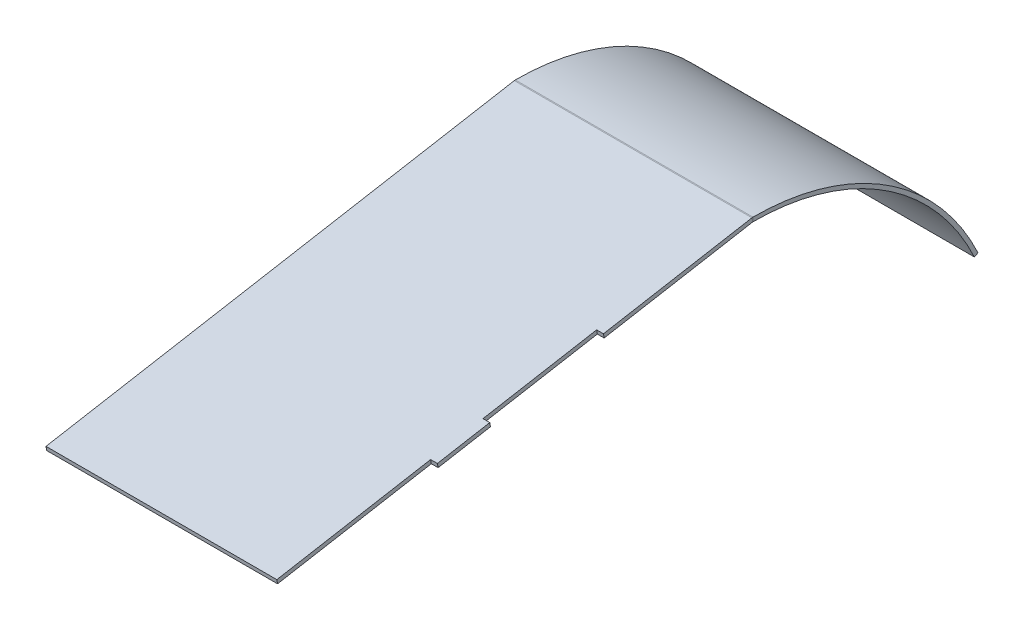
ISO-10303-21;
HEADER;
FILE_DESCRIPTION(('STEP AP214'),'2;1');
FILE_NAME('part.step','',(''),(''),'','','');
FILE_SCHEMA(('AUTOMOTIVE_DESIGN { 1 0 10303 214 1 1 1 1 }'));
ENDSEC;
DATA;
#1=APPLICATION_CONTEXT('core data for automotive mechanical design processes');
#2=APPLICATION_PROTOCOL_DEFINITION('international standard','automotive_design',2000,#1);
#3=PRODUCT_CONTEXT('',#1,'mechanical');
#4=PRODUCT('Part','Part','',(#3));
#5=PRODUCT_RELATED_PRODUCT_CATEGORY('part','',(#4));
#6=PRODUCT_DEFINITION_FORMATION('','',#4);
#7=PRODUCT_DEFINITION_CONTEXT('part definition',#1,'design');
#8=PRODUCT_DEFINITION('design','',#6,#7);
#9=PRODUCT_DEFINITION_SHAPE('','',#8);
#10=(LENGTH_UNIT() NAMED_UNIT(*) SI_UNIT(.MILLI.,.METRE.));
#11=(NAMED_UNIT(*) PLANE_ANGLE_UNIT() SI_UNIT($,.RADIAN.));
#12=(NAMED_UNIT(*) SI_UNIT($,.STERADIAN.) SOLID_ANGLE_UNIT());
#13=UNCERTAINTY_MEASURE_WITH_UNIT(LENGTH_MEASURE(1.E-05),#10,'distance_accuracy_value','');
#14=(GEOMETRIC_REPRESENTATION_CONTEXT(3) GLOBAL_UNCERTAINTY_ASSIGNED_CONTEXT((#13)) GLOBAL_UNIT_ASSIGNED_CONTEXT((#10,
#11,#12)) REPRESENTATION_CONTEXT('',''));
#15=CARTESIAN_POINT('',(0.,0.,0.));
#16=DIRECTION('',(0.,0.,1.));
#17=DIRECTION('',(1.,0.,0.));
#18=AXIS2_PLACEMENT_3D('',#15,#16,#17);
#19=CARTESIAN_POINT('',(-678.,-257.000036931668,-353.116262587331));
#20=DIRECTION('',(1.,0.,0.));
#21=DIRECTION('',(0.,0.,-1.));
#22=AXIS2_PLACEMENT_3D('',#19,#20,#21);
#23=PLANE('',#22);
#24=DIRECTION('',(0.,0.984807753012207,0.173648177666934));
#25=VECTOR('',#24,1.);
#26=CARTESIAN_POINT('',(-678.,-294.064206403001,-159.812285526964));
#27=LINE('',#26,#25);
#28=CARTESIAN_POINT('',(-678.,-294.064206403001,-159.812285526964));
#29=VERTEX_POINT('',#28);
#30=CARTESIAN_POINT('',(-678.,-291.109783143964,-159.291340993963));
#31=VERTEX_POINT('',#30);
#32=EDGE_CURVE('E178',#29,#31,#27,.T.);
#33=ORIENTED_EDGE('',*,*,#32,.T.);
#34=DIRECTION('',(0.,-0.173648177666934,0.984807753012207));
#35=VECTOR('',#34,1.);
#36=CARTESIAN_POINT('',(-678.,-257.045576740963,-352.479055466999));
#37=LINE('',#36,#35);
#38=CARTESIAN_POINT('',(-678.,-297.908844653688,-120.731947063403));
#39=VERTEX_POINT('',#38);
#40=EDGE_CURVE('E168',#31,#39,#37,.T.);
#41=ORIENTED_EDGE('',*,*,#40,.T.);
#42=DIRECTION('',(0.,0.984807753012207,0.173648177666934));
#43=VECTOR('',#42,1.);
#44=CARTESIAN_POINT('',(-678.,-300.863267912725,-121.252891596403));
#45=LINE('',#44,#43);
#46=CARTESIAN_POINT('',(-678.,-300.863267912725,-121.252891596403));
#47=VERTEX_POINT('',#46);
#48=EDGE_CURVE('E56',#47,#39,#45,.T.);
#49=ORIENTED_EDGE('',*,*,#48,.F.);
#50=DIRECTION('',(0.,-0.173648177666934,0.984807753012207));
#51=VECTOR('',#50,1.);
#52=CARTESIAN_POINT('',(-678.,-260.,-353.));
#53=LINE('',#52,#51);
#54=EDGE_CURVE('E169',#29,#47,#53,.T.);
#55=ORIENTED_EDGE('',*,*,#54,.F.);
#56=EDGE_LOOP('',(#33,#41,#49,#55));
#57=FACE_BOUND('',#56,.T.);
#58=ADVANCED_FACE('F40',(#57),#23,.T.);
#59=CARTESIAN_POINT('',(-853.,-260.000036326231,-353.114356643276));
#60=DIRECTION('',(-1.,0.,0.));
#61=DIRECTION('',(0.,0.,1.));
#62=AXIS2_PLACEMENT_3D('',#59,#60,#61);
#63=PLANE('',#62);
#64=DIRECTION('',(0.,0.999999798187605,-0.000635314684878851));
#65=VECTOR('',#64,1.);
#66=CARTESIAN_POINT('',(-853.,-260.000036326231,-353.114356643276));
#67=LINE('',#66,#65);
#68=CARTESIAN_POINT('',(-853.,-260.000036326231,-353.114356643276));
#69=VERTEX_POINT('',#68);
#70=CARTESIAN_POINT('',(-853.,-257.000036931668,-353.116262587331));
#71=VERTEX_POINT('',#70);
#72=EDGE_CURVE('E11',#69,#71,#67,.T.);
#73=ORIENTED_EDGE('',*,*,#72,.F.);
#74=CARTESIAN_POINT('',(-853.,-261.300036063875,-353.113530734186));
#75=DIRECTION('',(1.,0.,0.));
#76=DIRECTION('',(0.,0.,-1.));
#77=AXIS2_PLACEMENT_3D('',#74,#75,#76);
#78=CIRCLE('',#77,1.3);
#79=CARTESIAN_POINT('',(-853.,-260.019785984959,-352.887788103219));
#80=VERTEX_POINT('',#79);
#81=EDGE_CURVE('E180',#69,#80,#78,.T.);
#82=ORIENTED_EDGE('',*,*,#81,.T.);
#83=DIRECTION('',(0.,-0.984807753012209,-0.173648177666927));
#84=VECTOR('',#83,1.);
#85=CARTESIAN_POINT('',(-853.,-257.065362725923,-352.366843570218));
#86=LINE('',#85,#84);
#87=CARTESIAN_POINT('',(-853.,-257.065362725923,-352.366843570218));
#88=VERTEX_POINT('',#87);
#89=EDGE_CURVE('E49',#88,#80,#86,.T.);
#90=ORIENTED_EDGE('',*,*,#89,.F.);
#91=CARTESIAN_POINT('',(-853.,-261.300036063875,-353.113530734186));
#92=DIRECTION('',(-1.,0.,0.));
#93=DIRECTION('',(0.,0.,1.));
#94=AXIS2_PLACEMENT_3D('',#91,#92,#93);
#95=CIRCLE('',#94,4.3);
#96=EDGE_CURVE('E272',#71,#88,#95,.F.);
#97=ORIENTED_EDGE('',*,*,#96,.F.);
#98=EDGE_LOOP('',(#73,#82,#90,#97));
#99=FACE_BOUND('',#98,.T.);
#100=ADVANCED_FACE('F42',(#99),#63,.T.);
#101=CARTESIAN_POINT('',(-853.,-257.065362725923,-352.366843570218));
#102=DIRECTION('',(-1.,0.,0.));
#103=DIRECTION('',(0.,0.,1.));
#104=AXIS2_PLACEMENT_3D('',#101,#102,#103);
#105=PLANE('',#104);
#106=CARTESIAN_POINT('',(-853.,-440.,-353.));
#107=DIRECTION('',(1.,0.,0.));
#108=DIRECTION('',(0.,0.,-1.));
#109=AXIS2_PLACEMENT_3D('',#106,#107,#108);
#110=CIRCLE('',#109,180.);
#111=CARTESIAN_POINT('',(-853.,-363.928712886675,-516.135401666597));
#112=VERTEX_POINT('',#111);
#113=EDGE_CURVE('E256',#112,#69,#110,.T.);
#114=ORIENTED_EDGE('',*,*,#113,.T.);
#115=ORIENTED_EDGE('',*,*,#72,.T.);
#116=CARTESIAN_POINT('',(-853.,-440.,-353.));
#117=DIRECTION('',(-1.,0.,0.));
#118=DIRECTION('',(0.,0.,1.));
#119=AXIS2_PLACEMENT_3D('',#116,#117,#118);
#120=CIRCLE('',#119,183.);
#121=CARTESIAN_POINT('',(-853.,-362.660858101453,-518.854325027707));
#122=VERTEX_POINT('',#121);
#123=EDGE_CURVE('E274',#122,#71,#120,.F.);
#124=ORIENTED_EDGE('',*,*,#123,.F.);
#125=DIRECTION('',(0.,0.422618261740682,-0.906307787036658));
#126=VECTOR('',#125,1.);
#127=CARTESIAN_POINT('',(-853.,-363.928712886675,-516.135401666597));
#128=LINE('',#127,#126);
#129=EDGE_CURVE('E278',#112,#122,#128,.T.);
#130=ORIENTED_EDGE('',*,*,#129,.F.);
#131=EDGE_LOOP('',(#114,#115,#124,#130));
#132=FACE_BOUND('',#131,.T.);
#133=ADVANCED_FACE('F287',(#132),#105,.T.);
#134=CARTESIAN_POINT('',(-678.,-260.019785984959,-352.887788103219));
#135=DIRECTION('',(1.,0.,0.));
#136=DIRECTION('',(0.,0.,-1.));
#137=AXIS2_PLACEMENT_3D('',#134,#135,#136);
#138=PLANE('',#137);
#139=DIRECTION('',(0.,0.984807753012209,0.173648177666927));
#140=VECTOR('',#139,1.);
#141=CARTESIAN_POINT('',(-678.,-260.019785984959,-352.887788103219));
#142=LINE('',#141,#140);
#143=CARTESIAN_POINT('',(-678.,-260.019785984959,-352.887788103219));
#144=VERTEX_POINT('',#143);
#145=CARTESIAN_POINT('',(-678.,-257.065362725923,-352.366843570218));
#146=VERTEX_POINT('',#145);
#147=EDGE_CURVE('E235',#144,#146,#142,.T.);
#148=ORIENTED_EDGE('',*,*,#147,.F.);
#149=CARTESIAN_POINT('',(-678.,-261.300036063875,-353.113530734186));
#150=DIRECTION('',(1.,0.,0.));
#151=DIRECTION('',(0.,0.,-1.));
#152=AXIS2_PLACEMENT_3D('',#149,#150,#151);
#153=CIRCLE('',#152,1.3);
#154=CARTESIAN_POINT('',(-678.,-260.000036326231,-353.114356643276));
#155=VERTEX_POINT('',#154);
#156=EDGE_CURVE('E199',#155,#144,#153,.T.);
#157=ORIENTED_EDGE('',*,*,#156,.F.);
#158=DIRECTION('',(0.,-0.999999798187605,0.000635314684878851));
#159=VECTOR('',#158,1.);
#160=CARTESIAN_POINT('',(-678.,-257.000036931668,-353.116262587331));
#161=LINE('',#160,#159);
#162=CARTESIAN_POINT('',(-678.,-257.000036931668,-353.116262587331));
#163=VERTEX_POINT('',#162);
#164=EDGE_CURVE('E232',#163,#155,#161,.T.);
#165=ORIENTED_EDGE('',*,*,#164,.F.);
#166=CARTESIAN_POINT('',(-678.,-261.300036063875,-353.113530734186));
#167=DIRECTION('',(-1.,0.,0.));
#168=DIRECTION('',(0.,0.,1.));
#169=AXIS2_PLACEMENT_3D('',#166,#167,#168);
#170=CIRCLE('',#169,4.3);
#171=EDGE_CURVE('E183',#163,#146,#170,.F.);
#172=ORIENTED_EDGE('',*,*,#171,.T.);
#173=EDGE_LOOP('',(#148,#157,#165,#172));
#174=FACE_BOUND('',#173,.T.);
#175=ADVANCED_FACE('F294',(#174),#138,.T.);
#176=DIRECTION('',(0.,0.984807753012207,0.173648177666934));
#177=VECTOR('',#176,1.);
#178=CARTESIAN_POINT('',(-678.,-279.304111301311,-243.520944533001));
#179=LINE('',#178,#177);
#180=CARTESIAN_POINT('',(-678.,-279.304111301311,-243.520944533001));
#181=VERTEX_POINT('',#180);
#182=CARTESIAN_POINT('',(-678.,-276.349688042274,-243.));
#183=VERTEX_POINT('',#182);
#184=EDGE_CURVE('E64',#181,#183,#179,.T.);
#185=ORIENTED_EDGE('',*,*,#184,.F.);
#186=EDGE_CURVE('E156',#144,#181,#53,.T.);
#187=ORIENTED_EDGE('',*,*,#186,.F.);
#188=ORIENTED_EDGE('',*,*,#147,.T.);
#189=EDGE_CURVE('E158',#146,#183,#37,.T.);
#190=ORIENTED_EDGE('',*,*,#189,.T.);
#191=EDGE_LOOP('',(#185,#187,#188,#190));
#192=FACE_BOUND('',#191,.T.);
#193=ADVANCED_FACE('F155',(#192),#23,.T.);
#194=CARTESIAN_POINT('',(-853.,-260.,-353.));
#195=DIRECTION('',(0.,0.984807753012207,0.173648177666934));
#196=DIRECTION('',(0.,-0.173648177666934,0.984807753012207));
#197=AXIS2_PLACEMENT_3D('',#194,#195,#196);
#198=PLANE('',#197);
#199=DIRECTION('',(0.,-0.173648177666934,0.984807753012207));
#200=VECTOR('',#199,1.);
#201=CARTESIAN_POINT('',(-683.,-279.304111301311,-243.520944533001));
#202=LINE('',#201,#200);
#203=CARTESIAN_POINT('',(-683.,-279.304111301311,-243.520944533001));
#204=VERTEX_POINT('',#203);
#205=CARTESIAN_POINT('',(-683.,-294.064206403001,-159.812285526964));
#206=VERTEX_POINT('',#205);
#207=EDGE_CURVE('E149',#204,#206,#202,.T.);
#208=ORIENTED_EDGE('',*,*,#207,.T.);
#209=DIRECTION('',(1.,0.,0.));
#210=VECTOR('',#209,1.);
#211=CARTESIAN_POINT('',(-683.,-294.064206403001,-159.812285526964));
#212=LINE('',#211,#210);
#213=EDGE_CURVE('E160',#206,#29,#212,.T.);
#214=ORIENTED_EDGE('',*,*,#213,.T.);
#215=ORIENTED_EDGE('',*,*,#54,.T.);
#216=DIRECTION('',(-1.,0.,0.));
#217=VECTOR('',#216,1.);
#218=CARTESIAN_POINT('',(-678.,-300.863267912725,-121.252891596403));
#219=LINE('',#218,#217);
#220=CARTESIAN_POINT('',(-683.,-300.863267912725,-121.252891596403));
#221=VERTEX_POINT('',#220);
#222=EDGE_CURVE('E328',#47,#221,#219,.T.);
#223=ORIENTED_EDGE('',*,*,#222,.T.);
#224=DIRECTION('',(0.,-0.173648177666934,0.984807753012207));
#225=VECTOR('',#224,1.);
#226=CARTESIAN_POINT('',(-683.,-300.863267912725,-121.252891596403));
#227=LINE('',#226,#225);
#228=CARTESIAN_POINT('',(-683.,-320.832808344422,-7.9999999999996));
#229=VERTEX_POINT('',#228);
#230=EDGE_CURVE('E332',#221,#229,#227,.T.);
#231=ORIENTED_EDGE('',*,*,#230,.T.);
#232=DIRECTION('',(1.,0.,0.));
#233=VECTOR('',#232,1.);
#234=CARTESIAN_POINT('',(-853.,-320.832808344422,-7.99999999999956));
#235=LINE('',#234,#233);
#236=CARTESIAN_POINT('',(-853.,-320.832808344422,-7.99999999999956));
#237=VERTEX_POINT('',#236);
#238=EDGE_CURVE('E228',#237,#229,#235,.T.);
#239=ORIENTED_EDGE('',*,*,#238,.F.);
#240=DIRECTION('',(0.,-0.173648177666934,0.984807753012207));
#241=VECTOR('',#240,1.);
#242=CARTESIAN_POINT('',(-853.,-260.,-353.));
#243=LINE('',#242,#241);
#244=EDGE_CURVE('E203',#80,#237,#243,.T.);
#245=ORIENTED_EDGE('',*,*,#244,.F.);
#246=DIRECTION('',(1.,0.,0.));
#247=VECTOR('',#246,1.);
#248=CARTESIAN_POINT('',(-853.,-260.019785984959,-352.887788103219));
#249=LINE('',#248,#247);
#250=EDGE_CURVE('E166',#80,#144,#249,.T.);
#251=ORIENTED_EDGE('',*,*,#250,.T.);
#252=ORIENTED_EDGE('',*,*,#186,.T.);
#253=DIRECTION('',(-1.,0.,0.));
#254=VECTOR('',#253,1.);
#255=CARTESIAN_POINT('',(-678.,-279.304111301311,-243.520944533001));
#256=LINE('',#255,#254);
#257=EDGE_CURVE('E141',#181,#204,#256,.T.);
#258=ORIENTED_EDGE('',*,*,#257,.T.);
#259=EDGE_LOOP('',(#208,#214,#215,#223,#231,#239,#245,#251,#252,#258));
#260=FACE_BOUND('',#259,.T.);
#261=ADVANCED_FACE('F163',(#260),#198,.F.);
#262=CARTESIAN_POINT('',(-853.,-317.878385085385,-7.47905546699879));
#263=DIRECTION('',(0.,-0.173648177666926,0.984807753012209));
#264=DIRECTION('',(0.,-0.984807753012209,-0.173648177666926));
#265=AXIS2_PLACEMENT_3D('',#262,#263,#264);
#266=PLANE('',#265);
#267=DIRECTION('',(0.,0.984807753012207,0.173648177666934));
#268=VECTOR('',#267,1.);
#269=CARTESIAN_POINT('',(-683.,-320.832808344422,-7.9999999999996));
#270=LINE('',#269,#268);
#271=CARTESIAN_POINT('',(-683.,-317.878385085386,-7.4790554669988));
#272=VERTEX_POINT('',#271);
#273=EDGE_CURVE('E306',#229,#272,#270,.T.);
#274=ORIENTED_EDGE('',*,*,#273,.T.);
#275=DIRECTION('',(1.,0.,0.));
#276=VECTOR('',#275,1.);
#277=CARTESIAN_POINT('',(-853.,-317.878385085385,-7.47905546699879));
#278=LINE('',#277,#276);
#279=CARTESIAN_POINT('',(-853.,-317.878385085385,-7.47905546699879));
#280=VERTEX_POINT('',#279);
#281=EDGE_CURVE('E224',#280,#272,#278,.T.);
#282=ORIENTED_EDGE('',*,*,#281,.F.);
#283=DIRECTION('',(0.,-0.984807753012209,-0.173648177666926));
#284=VECTOR('',#283,1.);
#285=CARTESIAN_POINT('',(-853.,-317.878385085385,-7.47905546699879));
#286=LINE('',#285,#284);
#287=EDGE_CURVE('E262',#280,#237,#286,.T.);
#288=ORIENTED_EDGE('',*,*,#287,.T.);
#289=ORIENTED_EDGE('',*,*,#238,.T.);
#290=EDGE_LOOP('',(#274,#282,#288,#289));
#291=FACE_BOUND('',#290,.T.);
#292=ADVANCED_FACE('F356',(#291),#266,.T.);
#293=CARTESIAN_POINT('',(-853.,-257.045576740963,-352.479055466999));
#294=DIRECTION('',(0.,0.984807753012207,0.173648177666934));
#295=DIRECTION('',(0.,-0.173648177666934,0.984807753012207));
#296=AXIS2_PLACEMENT_3D('',#293,#294,#295);
#297=PLANE('',#296);
#298=DIRECTION('',(1.,0.,0.));
#299=VECTOR('',#298,1.);
#300=CARTESIAN_POINT('',(-683.,-291.109783143964,-159.291340993963));
#301=LINE('',#300,#299);
#302=CARTESIAN_POINT('',(-683.,-291.109783143964,-159.291340993963));
#303=VERTEX_POINT('',#302);
#304=EDGE_CURVE('E150',#303,#31,#301,.T.);
#305=ORIENTED_EDGE('',*,*,#304,.F.);
#306=DIRECTION('',(0.,-0.173648177666934,0.984807753012207));
#307=VECTOR('',#306,1.);
#308=CARTESIAN_POINT('',(-683.,-276.349688042275,-243.));
#309=LINE('',#308,#307);
#310=CARTESIAN_POINT('',(-683.,-276.349688042275,-243.));
#311=VERTEX_POINT('',#310);
#312=EDGE_CURVE('E304',#311,#303,#309,.T.);
#313=ORIENTED_EDGE('',*,*,#312,.F.);
#314=DIRECTION('',(-1.,0.,0.));
#315=VECTOR('',#314,1.);
#316=CARTESIAN_POINT('',(-678.,-276.349688042275,-243.));
#317=LINE('',#316,#315);
#318=EDGE_CURVE('E302',#183,#311,#317,.T.);
#319=ORIENTED_EDGE('',*,*,#318,.F.);
#320=ORIENTED_EDGE('',*,*,#189,.F.);
#321=DIRECTION('',(1.,0.,0.));
#322=VECTOR('',#321,1.);
#323=CARTESIAN_POINT('',(-853.,-257.065362725923,-352.366843570218));
#324=LINE('',#323,#322);
#325=EDGE_CURVE('E220',#88,#146,#324,.T.);
#326=ORIENTED_EDGE('',*,*,#325,.F.);
#327=DIRECTION('',(0.,-0.173648177666934,0.984807753012207));
#328=VECTOR('',#327,1.);
#329=CARTESIAN_POINT('',(-853.,-257.045576740963,-352.479055466999));
#330=LINE('',#329,#328);
#331=EDGE_CURVE('E248',#88,#280,#330,.T.);
#332=ORIENTED_EDGE('',*,*,#331,.T.);
#333=ORIENTED_EDGE('',*,*,#281,.T.);
#334=DIRECTION('',(0.,-0.173648177666934,0.984807753012207));
#335=VECTOR('',#334,1.);
#336=CARTESIAN_POINT('',(-683.,-297.908844653688,-120.731947063403));
#337=LINE('',#336,#335);
#338=CARTESIAN_POINT('',(-683.,-297.908844653688,-120.731947063403));
#339=VERTEX_POINT('',#338);
#340=EDGE_CURVE('E333',#339,#272,#337,.T.);
#341=ORIENTED_EDGE('',*,*,#340,.F.);
#342=DIRECTION('',(-1.,0.,0.));
#343=VECTOR('',#342,1.);
#344=CARTESIAN_POINT('',(-678.,-297.908844653688,-120.731947063403));
#345=LINE('',#344,#343);
#346=EDGE_CURVE('E336',#39,#339,#345,.T.);
#347=ORIENTED_EDGE('',*,*,#346,.F.);
#348=ORIENTED_EDGE('',*,*,#40,.F.);
#349=EDGE_LOOP('',(#305,#313,#319,#320,#326,#332,#333,#341,#347,#348));
#350=FACE_BOUND('',#349,.T.);
#351=ADVANCED_FACE('F300',(#350),#297,.T.);
#352=CARTESIAN_POINT('',(-853.,-261.300036063875,-353.113530734186));
#353=DIRECTION('',(1.,0.,0.));
#354=DIRECTION('',(0.,0.,-1.));
#355=AXIS2_PLACEMENT_3D('',#352,#353,#354);
#356=CYLINDRICAL_SURFACE('',#355,4.3);
#357=ORIENTED_EDGE('',*,*,#171,.F.);
#358=DIRECTION('',(1.,0.,0.));
#359=VECTOR('',#358,1.);
#360=CARTESIAN_POINT('',(-853.,-257.000036931668,-353.116262587331));
#361=LINE('',#360,#359);
#362=EDGE_CURVE('E216',#71,#163,#361,.T.);
#363=ORIENTED_EDGE('',*,*,#362,.F.);
#364=ORIENTED_EDGE('',*,*,#96,.T.);
#365=ORIENTED_EDGE('',*,*,#325,.T.);
#366=EDGE_LOOP('',(#357,#363,#364,#365));
#367=FACE_BOUND('',#366,.T.);
#368=ADVANCED_FACE('F297',(#367),#356,.T.);
#369=CARTESIAN_POINT('',(-853.,-440.,-353.));
#370=DIRECTION('',(1.,0.,0.));
#371=DIRECTION('',(0.,0.,-1.));
#372=AXIS2_PLACEMENT_3D('',#369,#370,#371);
#373=CYLINDRICAL_SURFACE('',#372,183.);
#374=CARTESIAN_POINT('',(-678.,-440.,-353.));
#375=DIRECTION('',(-1.,0.,0.));
#376=DIRECTION('',(0.,0.,1.));
#377=AXIS2_PLACEMENT_3D('',#374,#375,#376);
#378=CIRCLE('',#377,183.);
#379=CARTESIAN_POINT('',(-678.,-362.660858101453,-518.854325027707));
#380=VERTEX_POINT('',#379);
#381=EDGE_CURVE('E187',#380,#163,#378,.F.);
#382=ORIENTED_EDGE('',*,*,#381,.F.);
#383=DIRECTION('',(1.,0.,0.));
#384=VECTOR('',#383,1.);
#385=CARTESIAN_POINT('',(-853.,-362.660858101453,-518.854325027707));
#386=LINE('',#385,#384);
#387=EDGE_CURVE('E213',#122,#380,#386,.T.);
#388=ORIENTED_EDGE('',*,*,#387,.F.);
#389=ORIENTED_EDGE('',*,*,#123,.T.);
#390=ORIENTED_EDGE('',*,*,#362,.T.);
#391=EDGE_LOOP('',(#382,#388,#389,#390));
#392=FACE_BOUND('',#391,.T.);
#393=ADVANCED_FACE('F462',(#392),#373,.T.);
#394=CARTESIAN_POINT('',(-853.,-363.928712886675,-516.135401666597));
#395=DIRECTION('',(0.,-0.906307787036658,-0.422618261740682));
#396=DIRECTION('',(0.,0.422618261740682,-0.906307787036658));
#397=AXIS2_PLACEMENT_3D('',#394,#395,#396);
#398=PLANE('',#397);
#399=DIRECTION('',(0.,0.422618261740682,-0.906307787036658));
#400=VECTOR('',#399,1.);
#401=CARTESIAN_POINT('',(-678.,-363.928712886675,-516.135401666597));
#402=LINE('',#401,#400);
#403=CARTESIAN_POINT('',(-678.,-363.928712886675,-516.135401666597));
#404=VERTEX_POINT('',#403);
#405=EDGE_CURVE('E191',#404,#380,#402,.T.);
#406=ORIENTED_EDGE('',*,*,#405,.F.);
#407=DIRECTION('',(1.,0.,0.));
#408=VECTOR('',#407,1.);
#409=CARTESIAN_POINT('',(-853.,-363.928712886675,-516.135401666597));
#410=LINE('',#409,#408);
#411=EDGE_CURVE('E210',#112,#404,#410,.T.);
#412=ORIENTED_EDGE('',*,*,#411,.F.);
#413=ORIENTED_EDGE('',*,*,#129,.T.);
#414=ORIENTED_EDGE('',*,*,#387,.T.);
#415=EDGE_LOOP('',(#406,#412,#413,#414));
#416=FACE_BOUND('',#415,.T.);
#417=ADVANCED_FACE('F454',(#416),#398,.T.);
#418=CARTESIAN_POINT('',(-853.,-440.,-353.));
#419=DIRECTION('',(1.,0.,0.));
#420=DIRECTION('',(0.,0.,-1.));
#421=AXIS2_PLACEMENT_3D('',#418,#419,#420);
#422=CYLINDRICAL_SURFACE('',#421,180.);
#423=CARTESIAN_POINT('',(-678.,-440.,-353.));
#424=DIRECTION('',(1.,0.,0.));
#425=DIRECTION('',(0.,0.,-1.));
#426=AXIS2_PLACEMENT_3D('',#423,#424,#425);
#427=CIRCLE('',#426,180.);
#428=EDGE_CURVE('E195',#404,#155,#427,.T.);
#429=ORIENTED_EDGE('',*,*,#428,.T.);
#430=DIRECTION('',(1.,0.,0.));
#431=VECTOR('',#430,1.);
#432=CARTESIAN_POINT('',(-853.,-260.000036326231,-353.114356643276));
#433=LINE('',#432,#431);
#434=EDGE_CURVE('E206',#69,#155,#433,.T.);
#435=ORIENTED_EDGE('',*,*,#434,.F.);
#436=ORIENTED_EDGE('',*,*,#113,.F.);
#437=ORIENTED_EDGE('',*,*,#411,.T.);
#438=EDGE_LOOP('',(#429,#435,#436,#437));
#439=FACE_BOUND('',#438,.T.);
#440=ADVANCED_FACE('F291',(#439),#422,.F.);
#441=CARTESIAN_POINT('',(-853.,-261.300036063875,-353.113530734186));
#442=DIRECTION('',(1.,0.,0.));
#443=DIRECTION('',(0.,0.,-1.));
#444=AXIS2_PLACEMENT_3D('',#441,#442,#443);
#445=CYLINDRICAL_SURFACE('',#444,1.3);
#446=ORIENTED_EDGE('',*,*,#156,.T.);
#447=ORIENTED_EDGE('',*,*,#250,.F.);
#448=ORIENTED_EDGE('',*,*,#81,.F.);
#449=ORIENTED_EDGE('',*,*,#434,.T.);
#450=EDGE_LOOP('',(#446,#447,#448,#449));
#451=FACE_BOUND('',#450,.T.);
#452=ADVANCED_FACE('F257',(#451),#445,.F.);
#453=CARTESIAN_POINT('',(-853.,-261.300036063875,-353.113530734186));
#454=DIRECTION('',(-1.,0.,0.));
#455=DIRECTION('',(0.,0.,1.));
#456=AXIS2_PLACEMENT_3D('',#453,#454,#455);
#457=PLANE('',#456);
#458=ORIENTED_EDGE('',*,*,#244,.T.);
#459=ORIENTED_EDGE('',*,*,#287,.F.);
#460=ORIENTED_EDGE('',*,*,#331,.F.);
#461=ORIENTED_EDGE('',*,*,#89,.T.);
#462=EDGE_LOOP('',(#458,#459,#460,#461));
#463=FACE_BOUND('',#462,.T.);
#464=ADVANCED_FACE('F244',(#463),#457,.T.);
#465=CARTESIAN_POINT('',(-678.,-261.300036063875,-353.113530734186));
#466=DIRECTION('',(-1.,0.,0.));
#467=DIRECTION('',(0.,0.,1.));
#468=AXIS2_PLACEMENT_3D('',#465,#466,#467);
#469=PLANE('',#468);
#470=ORIENTED_EDGE('',*,*,#381,.T.);
#471=ORIENTED_EDGE('',*,*,#164,.T.);
#472=ORIENTED_EDGE('',*,*,#428,.F.);
#473=ORIENTED_EDGE('',*,*,#405,.T.);
#474=EDGE_LOOP('',(#470,#471,#472,#473));
#475=FACE_BOUND('',#474,.T.);
#476=ADVANCED_FACE('F474',(#475),#469,.F.);
#477=CARTESIAN_POINT('',(-683.,-300.863267912725,-121.252891596403));
#478=DIRECTION('',(-1.,0.,0.));
#479=DIRECTION('',(0.,0.,1.));
#480=AXIS2_PLACEMENT_3D('',#477,#478,#479);
#481=PLANE('',#480);
#482=ORIENTED_EDGE('',*,*,#340,.T.);
#483=ORIENTED_EDGE('',*,*,#273,.F.);
#484=ORIENTED_EDGE('',*,*,#230,.F.);
#485=DIRECTION('',(0.,0.984807753012207,0.173648177666934));
#486=VECTOR('',#485,1.);
#487=CARTESIAN_POINT('',(-683.,-300.863267912725,-121.252891596403));
#488=LINE('',#487,#486);
#489=EDGE_CURVE('E313',#221,#339,#488,.T.);
#490=ORIENTED_EDGE('',*,*,#489,.T.);
#491=EDGE_LOOP('',(#482,#483,#484,#490));
#492=FACE_BOUND('',#491,.T.);
#493=ADVANCED_FACE('F351',(#492),#481,.F.);
#494=CARTESIAN_POINT('',(-678.,-300.863267912725,-121.252891596403));
#495=DIRECTION('',(0.,0.173648177666934,-0.984807753012207));
#496=DIRECTION('',(0.,0.984807753012207,0.173648177666934));
#497=AXIS2_PLACEMENT_3D('',#494,#495,#496);
#498=PLANE('',#497);
#499=ORIENTED_EDGE('',*,*,#346,.T.);
#500=ORIENTED_EDGE('',*,*,#489,.F.);
#501=ORIENTED_EDGE('',*,*,#222,.F.);
#502=ORIENTED_EDGE('',*,*,#48,.T.);
#503=EDGE_LOOP('',(#499,#500,#501,#502));
#504=FACE_BOUND('',#503,.T.);
#505=ADVANCED_FACE('F353',(#504),#498,.F.);
#506=CARTESIAN_POINT('',(-683.,-294.064206403001,-159.812285526964));
#507=DIRECTION('',(0.,-0.173648177666934,0.984807753012207));
#508=DIRECTION('',(0.,-0.984807753012207,-0.173648177666934));
#509=AXIS2_PLACEMENT_3D('',#506,#507,#508);
#510=PLANE('',#509);
#511=ORIENTED_EDGE('',*,*,#304,.T.);
#512=ORIENTED_EDGE('',*,*,#32,.F.);
#513=ORIENTED_EDGE('',*,*,#213,.F.);
#514=DIRECTION('',(0.,0.984807753012207,0.173648177666934));
#515=VECTOR('',#514,1.);
#516=CARTESIAN_POINT('',(-683.,-294.064206403001,-159.812285526964));
#517=LINE('',#516,#515);
#518=EDGE_CURVE('E323',#206,#303,#517,.T.);
#519=ORIENTED_EDGE('',*,*,#518,.T.);
#520=EDGE_LOOP('',(#511,#512,#513,#519));
#521=FACE_BOUND('',#520,.T.);
#522=ADVANCED_FACE('F361',(#521),#510,.F.);
#523=CARTESIAN_POINT('',(-683.,-279.304111301311,-243.520944533001));
#524=DIRECTION('',(-1.,0.,0.));
#525=DIRECTION('',(0.,0.,1.));
#526=AXIS2_PLACEMENT_3D('',#523,#524,#525);
#527=PLANE('',#526);
#528=ORIENTED_EDGE('',*,*,#312,.T.);
#529=ORIENTED_EDGE('',*,*,#518,.F.);
#530=ORIENTED_EDGE('',*,*,#207,.F.);
#531=DIRECTION('',(0.,0.984807753012207,0.173648177666934));
#532=VECTOR('',#531,1.);
#533=CARTESIAN_POINT('',(-683.,-279.304111301311,-243.520944533001));
#534=LINE('',#533,#532);
#535=EDGE_CURVE('E143',#204,#311,#534,.T.);
#536=ORIENTED_EDGE('',*,*,#535,.T.);
#537=EDGE_LOOP('',(#528,#529,#530,#536));
#538=FACE_BOUND('',#537,.T.);
#539=ADVANCED_FACE('F364',(#538),#527,.F.);
#540=CARTESIAN_POINT('',(-678.,-279.304111301311,-243.520944533001));
#541=DIRECTION('',(0.,0.173648177666934,-0.984807753012207));
#542=DIRECTION('',(0.,0.984807753012207,0.173648177666934));
#543=AXIS2_PLACEMENT_3D('',#540,#541,#542);
#544=PLANE('',#543);
#545=ORIENTED_EDGE('',*,*,#318,.T.);
#546=ORIENTED_EDGE('',*,*,#535,.F.);
#547=ORIENTED_EDGE('',*,*,#257,.F.);
#548=ORIENTED_EDGE('',*,*,#184,.T.);
#549=EDGE_LOOP('',(#545,#546,#547,#548));
#550=FACE_BOUND('',#549,.T.);
#551=ADVANCED_FACE('F142',(#550),#544,.F.);
#552=CLOSED_SHELL('',(#58,#100,#133,#175,#193,#261,#292,#351,#368,#393,#417,#440,#452,#464,#476,
#493,#505,#522,#539,#551));
#553=MANIFOLD_SOLID_BREP('B2',#552);
#554=ADVANCED_BREP_SHAPE_REPRESENTATION('',(#18,#553),#14);
#555=SHAPE_DEFINITION_REPRESENTATION(#9,#554);
ENDSEC;
END-ISO-10303-21;
